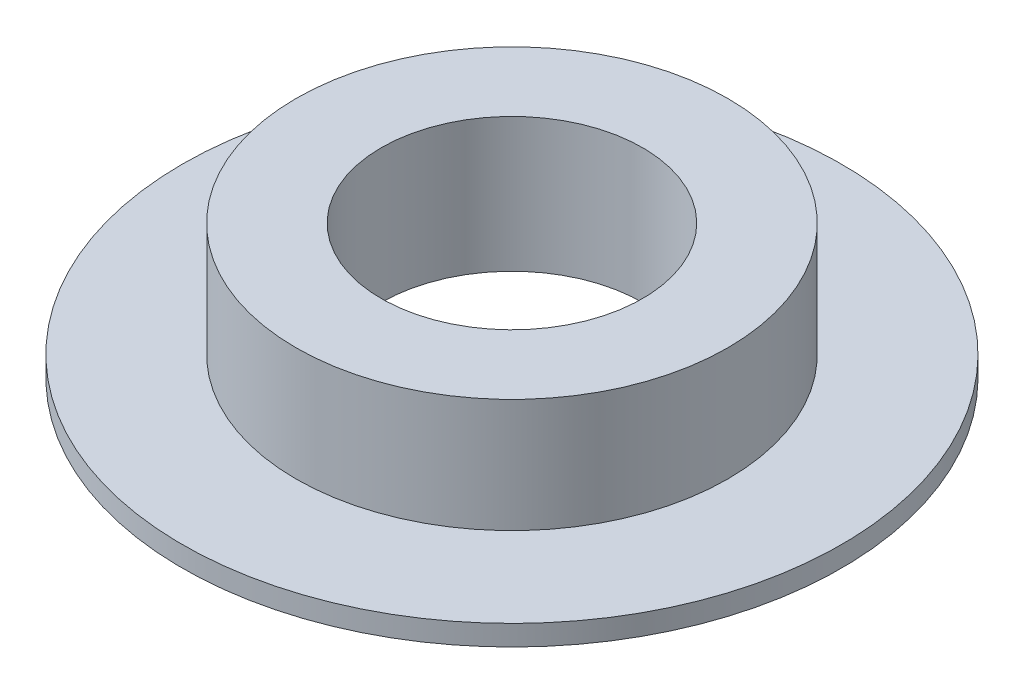
ISO-10303-21;
HEADER;
FILE_DESCRIPTION(('STEP AP214'),'2;1');
FILE_NAME('part.step','',(''),(''),'','','');
FILE_SCHEMA(('AUTOMOTIVE_DESIGN { 1 0 10303 214 1 1 1 1 }'));
ENDSEC;
DATA;
#1=APPLICATION_CONTEXT('core data for automotive mechanical design processes');
#2=APPLICATION_PROTOCOL_DEFINITION('international standard','automotive_design',2000,#1);
#3=PRODUCT_CONTEXT('',#1,'mechanical');
#4=PRODUCT('Part','Part','',(#3));
#5=PRODUCT_RELATED_PRODUCT_CATEGORY('part','',(#4));
#6=PRODUCT_DEFINITION_FORMATION('','',#4);
#7=PRODUCT_DEFINITION_CONTEXT('part definition',#1,'design');
#8=PRODUCT_DEFINITION('design','',#6,#7);
#9=PRODUCT_DEFINITION_SHAPE('','',#8);
#10=(LENGTH_UNIT() NAMED_UNIT(*) SI_UNIT(.MILLI.,.METRE.));
#11=(NAMED_UNIT(*) PLANE_ANGLE_UNIT() SI_UNIT($,.RADIAN.));
#12=(NAMED_UNIT(*) SI_UNIT($,.STERADIAN.) SOLID_ANGLE_UNIT());
#13=UNCERTAINTY_MEASURE_WITH_UNIT(LENGTH_MEASURE(1.E-05),#10,'distance_accuracy_value','');
#14=(GEOMETRIC_REPRESENTATION_CONTEXT(3) GLOBAL_UNCERTAINTY_ASSIGNED_CONTEXT((#13)) GLOBAL_UNIT_ASSIGNED_CONTEXT((#10,
#11,#12)) REPRESENTATION_CONTEXT('',''));
#15=CARTESIAN_POINT('',(0.,0.,0.));
#16=DIRECTION('',(0.,0.,1.));
#17=DIRECTION('',(1.,0.,0.));
#18=AXIS2_PLACEMENT_3D('',#15,#16,#17);
#19=CARTESIAN_POINT('',(-48.5215872800419,8.97288931788123,0.));
#20=DIRECTION('',(0.,1.,0.));
#21=DIRECTION('',(-1.,0.,0.));
#22=AXIS2_PLACEMENT_3D('',#19,#20,#21);
#23=PLANE('',#22);
#24=CARTESIAN_POINT('',(-37.0215872800419,8.97288931788123,0.));
#25=DIRECTION('',(0.,1.,0.));
#26=DIRECTION('',(-1.,0.,0.));
#27=AXIS2_PLACEMENT_3D('',#24,#25,#26);
#28=CIRCLE('',#27,19.);
#29=CARTESIAN_POINT('',(-56.0215872800419,8.97288931788123,0.));
#30=VERTEX_POINT('',#29);
#31=EDGE_CURVE('E10',#30,#30,#28,.T.);
#32=ORIENTED_EDGE('',*,*,#31,.T.);
#33=EDGE_LOOP('',(#32));
#34=FACE_BOUND('',#33,.T.);
#35=CARTESIAN_POINT('',(-37.0215872800419,8.97288931788123,0.));
#36=DIRECTION('',(0.,1.,0.));
#37=DIRECTION('',(-1.,0.,0.));
#38=AXIS2_PLACEMENT_3D('',#35,#36,#37);
#39=CIRCLE('',#38,11.5);
#40=CARTESIAN_POINT('',(-48.5215872800419,8.97288931788123,0.));
#41=VERTEX_POINT('',#40);
#42=EDGE_CURVE('E53',#41,#41,#39,.T.);
#43=ORIENTED_EDGE('',*,*,#42,.F.);
#44=EDGE_LOOP('',(#43));
#45=FACE_BOUND('',#44,.T.);
#46=ADVANCED_FACE('F31',(#34,#45),#23,.T.);
#47=CARTESIAN_POINT('',(-37.0215872800419,13.9728893178812,0.));
#48=DIRECTION('',(0.,1.,0.));
#49=DIRECTION('',(-1.,0.,0.));
#50=AXIS2_PLACEMENT_3D('',#47,#48,#49);
#51=CYLINDRICAL_SURFACE('',#50,19.);
#52=CARTESIAN_POINT('',(-37.0215872800419,-1.02711068211877,0.));
#53=DIRECTION('',(0.,1.,0.));
#54=DIRECTION('',(-1.,0.,0.));
#55=AXIS2_PLACEMENT_3D('',#52,#53,#54);
#56=CIRCLE('',#55,19.);
#57=CARTESIAN_POINT('',(-56.0215872800419,-1.02711068211877,0.));
#58=VERTEX_POINT('',#57);
#59=EDGE_CURVE('E37',#58,#58,#56,.T.);
#60=ORIENTED_EDGE('',*,*,#59,.T.);
#61=EDGE_LOOP('',(#60));
#62=FACE_BOUND('',#61,.T.);
#63=ORIENTED_EDGE('',*,*,#31,.F.);
#64=EDGE_LOOP('',(#63));
#65=FACE_BOUND('',#64,.T.);
#66=ADVANCED_FACE('F61',(#62,#65),#51,.T.);
#67=CARTESIAN_POINT('',(-56.0215872800419,-1.02711068211877,0.));
#68=DIRECTION('',(0.,1.,0.));
#69=DIRECTION('',(-1.,0.,0.));
#70=AXIS2_PLACEMENT_3D('',#67,#68,#69);
#71=PLANE('',#70);
#72=CARTESIAN_POINT('',(-37.0215872800419,-1.02711068211877,0.));
#73=DIRECTION('',(0.,1.,0.));
#74=DIRECTION('',(-1.,0.,0.));
#75=AXIS2_PLACEMENT_3D('',#72,#73,#74);
#76=CIRCLE('',#75,29.);
#77=CARTESIAN_POINT('',(-66.0215872800419,-1.02711068211877,0.));
#78=VERTEX_POINT('',#77);
#79=EDGE_CURVE('E41',#78,#78,#76,.T.);
#80=ORIENTED_EDGE('',*,*,#79,.T.);
#81=EDGE_LOOP('',(#80));
#82=FACE_BOUND('',#81,.T.);
#83=ORIENTED_EDGE('',*,*,#59,.F.);
#84=EDGE_LOOP('',(#83));
#85=FACE_BOUND('',#84,.T.);
#86=ADVANCED_FACE('F65',(#82,#85),#71,.T.);
#87=CARTESIAN_POINT('',(-37.0215872800419,13.9728893178812,0.));
#88=DIRECTION('',(0.,1.,0.));
#89=DIRECTION('',(-1.,0.,0.));
#90=AXIS2_PLACEMENT_3D('',#87,#88,#89);
#91=CYLINDRICAL_SURFACE('',#90,29.);
#92=CARTESIAN_POINT('',(-37.0215872800419,-2.82711068211877,0.));
#93=DIRECTION('',(0.,1.,0.));
#94=DIRECTION('',(-1.,0.,0.));
#95=AXIS2_PLACEMENT_3D('',#92,#93,#94);
#96=CIRCLE('',#95,29.);
#97=CARTESIAN_POINT('',(-66.0215872800419,-2.82711068211877,0.));
#98=VERTEX_POINT('',#97);
#99=EDGE_CURVE('E45',#98,#98,#96,.T.);
#100=ORIENTED_EDGE('',*,*,#99,.T.);
#101=EDGE_LOOP('',(#100));
#102=FACE_BOUND('',#101,.T.);
#103=ORIENTED_EDGE('',*,*,#79,.F.);
#104=EDGE_LOOP('',(#103));
#105=FACE_BOUND('',#104,.T.);
#106=ADVANCED_FACE('F69',(#102,#105),#91,.T.);
#107=CARTESIAN_POINT('',(-66.0215872800419,-2.82711068211877,0.));
#108=DIRECTION('',(0.,-1.,0.));
#109=DIRECTION('',(1.,0.,0.));
#110=AXIS2_PLACEMENT_3D('',#107,#108,#109);
#111=PLANE('',#110);
#112=CARTESIAN_POINT('',(-37.0215872800419,-2.82711068211877,0.));
#113=DIRECTION('',(0.,1.,0.));
#114=DIRECTION('',(-1.,0.,0.));
#115=AXIS2_PLACEMENT_3D('',#112,#113,#114);
#116=CIRCLE('',#115,11.5);
#117=CARTESIAN_POINT('',(-48.5215872800419,-2.82711068211877,0.));
#118=VERTEX_POINT('',#117);
#119=EDGE_CURVE('E50',#118,#118,#116,.T.);
#120=ORIENTED_EDGE('',*,*,#119,.T.);
#121=EDGE_LOOP('',(#120));
#122=FACE_BOUND('',#121,.T.);
#123=ORIENTED_EDGE('',*,*,#99,.F.);
#124=EDGE_LOOP('',(#123));
#125=FACE_BOUND('',#124,.T.);
#126=ADVANCED_FACE('F76',(#122,#125),#111,.T.);
#127=CARTESIAN_POINT('',(-37.0215872800419,13.9728893178812,0.));
#128=DIRECTION('',(0.,1.,0.));
#129=DIRECTION('',(-1.,0.,0.));
#130=AXIS2_PLACEMENT_3D('',#127,#128,#129);
#131=CYLINDRICAL_SURFACE('',#130,11.5);
#132=ORIENTED_EDGE('',*,*,#42,.T.);
#133=EDGE_LOOP('',(#132));
#134=FACE_BOUND('',#133,.T.);
#135=ORIENTED_EDGE('',*,*,#119,.F.);
#136=EDGE_LOOP('',(#135));
#137=FACE_BOUND('',#136,.T.);
#138=ADVANCED_FACE('F57',(#134,#137),#131,.F.);
#139=CLOSED_SHELL('',(#46,#66,#86,#106,#126,#138));
#140=MANIFOLD_SOLID_BREP('B2',#139);
#141=ADVANCED_BREP_SHAPE_REPRESENTATION('',(#18,#140),#14);
#142=SHAPE_DEFINITION_REPRESENTATION(#9,#141);
ENDSEC;
END-ISO-10303-21;
